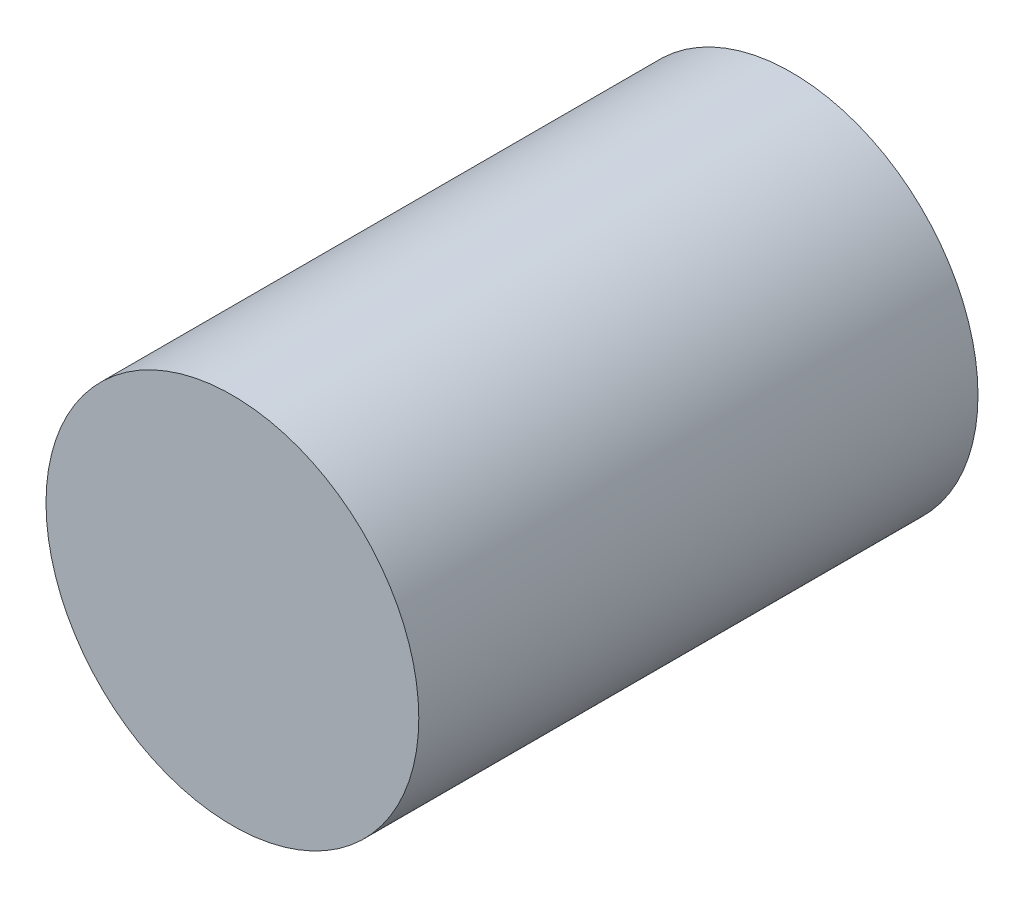
ISO-10303-21;
HEADER;
FILE_DESCRIPTION(('STEP AP214'),'2;1');
FILE_NAME('part.step','',(''),(''),'','','');
FILE_SCHEMA(('AUTOMOTIVE_DESIGN { 1 0 10303 214 1 1 1 1 }'));
ENDSEC;
DATA;
#1=APPLICATION_CONTEXT('core data for automotive mechanical design processes');
#2=APPLICATION_PROTOCOL_DEFINITION('international standard','automotive_design',2000,#1);
#3=PRODUCT_CONTEXT('',#1,'mechanical');
#4=PRODUCT('Part','Part','',(#3));
#5=PRODUCT_RELATED_PRODUCT_CATEGORY('part','',(#4));
#6=PRODUCT_DEFINITION_FORMATION('','',#4);
#7=PRODUCT_DEFINITION_CONTEXT('part definition',#1,'design');
#8=PRODUCT_DEFINITION('design','',#6,#7);
#9=PRODUCT_DEFINITION_SHAPE('','',#8);
#10=(LENGTH_UNIT() NAMED_UNIT(*) SI_UNIT(.MILLI.,.METRE.));
#11=(NAMED_UNIT(*) PLANE_ANGLE_UNIT() SI_UNIT($,.RADIAN.));
#12=(NAMED_UNIT(*) SI_UNIT($,.STERADIAN.) SOLID_ANGLE_UNIT());
#13=UNCERTAINTY_MEASURE_WITH_UNIT(LENGTH_MEASURE(1.E-05),#10,'distance_accuracy_value','');
#14=(GEOMETRIC_REPRESENTATION_CONTEXT(3) GLOBAL_UNCERTAINTY_ASSIGNED_CONTEXT((#13)) GLOBAL_UNIT_ASSIGNED_CONTEXT((#10,
#11,#12)) REPRESENTATION_CONTEXT('',''));
#15=CARTESIAN_POINT('',(0.,0.,0.));
#16=DIRECTION('',(0.,0.,1.));
#17=DIRECTION('',(1.,0.,0.));
#18=AXIS2_PLACEMENT_3D('',#15,#16,#17);
#19=CARTESIAN_POINT('',(0.,0.,6.));
#20=DIRECTION('',(0.,0.,-1.));
#21=DIRECTION('',(-1.,0.,0.));
#22=AXIS2_PLACEMENT_3D('',#19,#20,#21);
#23=CYLINDRICAL_SURFACE('',#22,2.);
#24=CARTESIAN_POINT('',(0.,0.,6.));
#25=DIRECTION('',(0.,0.,1.));
#26=DIRECTION('',(1.,0.,0.));
#27=AXIS2_PLACEMENT_3D('',#24,#25,#26);
#28=CIRCLE('',#27,2.);
#29=CARTESIAN_POINT('',(2.,0.,6.));
#30=VERTEX_POINT('',#29);
#31=EDGE_CURVE('E10',#30,#30,#28,.T.);
#32=ORIENTED_EDGE('',*,*,#31,.F.);
#33=EDGE_LOOP('',(#32));
#34=FACE_BOUND('',#33,.T.);
#35=CARTESIAN_POINT('',(0.,0.,0.));
#36=DIRECTION('',(0.,0.,1.));
#37=DIRECTION('',(1.,0.,0.));
#38=AXIS2_PLACEMENT_3D('',#35,#36,#37);
#39=CIRCLE('',#38,2.);
#40=CARTESIAN_POINT('',(2.,0.,0.));
#41=VERTEX_POINT('',#40);
#42=EDGE_CURVE('E40',#41,#41,#39,.T.);
#43=ORIENTED_EDGE('',*,*,#42,.T.);
#44=EDGE_LOOP('',(#43));
#45=FACE_BOUND('',#44,.T.);
#46=ADVANCED_FACE('F37',(#34,#45),#23,.T.);
#47=CARTESIAN_POINT('',(0.,0.,6.));
#48=DIRECTION('',(0.,0.,1.));
#49=DIRECTION('',(1.,0.,0.));
#50=AXIS2_PLACEMENT_3D('',#47,#48,#49);
#51=PLANE('',#50);
#52=ORIENTED_EDGE('',*,*,#31,.T.);
#53=EDGE_LOOP('',(#52));
#54=FACE_BOUND('',#53,.T.);
#55=ADVANCED_FACE('F54',(#54),#51,.T.);
#56=CARTESIAN_POINT('',(0.,0.,0.));
#57=DIRECTION('',(0.,0.,1.));
#58=DIRECTION('',(1.,0.,0.));
#59=AXIS2_PLACEMENT_3D('',#56,#57,#58);
#60=PLANE('',#59);
#61=ORIENTED_EDGE('',*,*,#42,.F.);
#62=EDGE_LOOP('',(#61));
#63=FACE_BOUND('',#62,.T.);
#64=ADVANCED_FACE('F52',(#63),#60,.F.);
#65=CLOSED_SHELL('',(#46,#55,#64));
#66=MANIFOLD_SOLID_BREP('B2',#65);
#67=ADVANCED_BREP_SHAPE_REPRESENTATION('',(#18,#66),#14);
#68=SHAPE_DEFINITION_REPRESENTATION(#9,#67);
ENDSEC;
END-ISO-10303-21;
